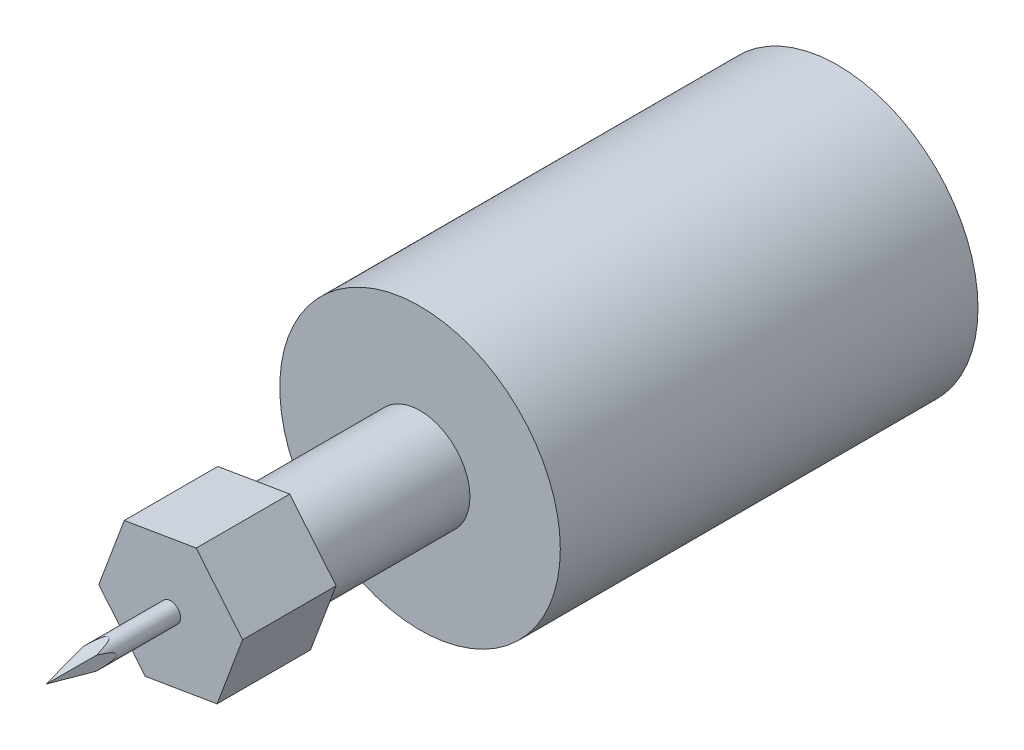
ISO-10303-21;
HEADER;
FILE_DESCRIPTION(('STEP AP214'),'2;1');
FILE_NAME('part.step','',(''),(''),'','','');
FILE_SCHEMA(('AUTOMOTIVE_DESIGN { 1 0 10303 214 1 1 1 1 }'));
ENDSEC;
DATA;
#1=APPLICATION_CONTEXT('core data for automotive mechanical design processes');
#2=APPLICATION_PROTOCOL_DEFINITION('international standard','automotive_design',2000,#1);
#3=PRODUCT_CONTEXT('',#1,'mechanical');
#4=PRODUCT('Part','Part','',(#3));
#5=PRODUCT_RELATED_PRODUCT_CATEGORY('part','',(#4));
#6=PRODUCT_DEFINITION_FORMATION('','',#4);
#7=PRODUCT_DEFINITION_CONTEXT('part definition',#1,'design');
#8=PRODUCT_DEFINITION('design','',#6,#7);
#9=PRODUCT_DEFINITION_SHAPE('','',#8);
#10=(LENGTH_UNIT() NAMED_UNIT(*) SI_UNIT(.MILLI.,.METRE.));
#11=(NAMED_UNIT(*) PLANE_ANGLE_UNIT() SI_UNIT($,.RADIAN.));
#12=(NAMED_UNIT(*) SI_UNIT($,.STERADIAN.) SOLID_ANGLE_UNIT());
#13=UNCERTAINTY_MEASURE_WITH_UNIT(LENGTH_MEASURE(1.E-05),#10,'distance_accuracy_value','');
#14=(GEOMETRIC_REPRESENTATION_CONTEXT(3) GLOBAL_UNCERTAINTY_ASSIGNED_CONTEXT((#13)) GLOBAL_UNIT_ASSIGNED_CONTEXT((#10,
#11,#12)) REPRESENTATION_CONTEXT('',''));
#15=CARTESIAN_POINT('',(0.,0.,0.));
#16=DIRECTION('',(0.,0.,1.));
#17=DIRECTION('',(1.,0.,0.));
#18=AXIS2_PLACEMENT_3D('',#15,#16,#17);
#19=CARTESIAN_POINT('',(0.,0.,0.));
#20=DIRECTION('',(0.,0.,1.));
#21=DIRECTION('',(1.,0.,0.));
#22=AXIS2_PLACEMENT_3D('',#19,#20,#21);
#23=PLANE('',#22);
#24=CARTESIAN_POINT('',(0.,0.,0.));
#25=DIRECTION('',(0.,0.,1.));
#26=DIRECTION('',(1.,0.,0.));
#27=AXIS2_PLACEMENT_3D('',#24,#25,#26);
#28=CIRCLE('',#27,22.5);
#29=CARTESIAN_POINT('',(22.5,0.,0.));
#30=VERTEX_POINT('',#29);
#31=EDGE_CURVE('E233',#30,#30,#28,.T.);
#32=ORIENTED_EDGE('',*,*,#31,.F.);
#33=EDGE_LOOP('',(#32));
#34=FACE_BOUND('',#33,.T.);
#35=CARTESIAN_POINT('',(0.,0.,0.));
#36=DIRECTION('',(0.,0.,1.));
#37=DIRECTION('',(1.,0.,0.));
#38=AXIS2_PLACEMENT_3D('',#35,#36,#37);
#39=CIRCLE('',#38,17.8959269683156);
#40=CARTESIAN_POINT('',(17.8959269683156,0.,0.));
#41=VERTEX_POINT('',#40);
#42=EDGE_CURVE('E12',#41,#41,#39,.F.);
#43=ORIENTED_EDGE('',*,*,#42,.F.);
#44=EDGE_LOOP('',(#43));
#45=FACE_BOUND('',#44,.T.);
#46=ADVANCED_FACE('F106',(#34,#45),#23,.F.);
#47=CARTESIAN_POINT('',(0.,0.,127.));
#48=DIRECTION('',(0.,0.,-1.));
#49=DIRECTION('',(-1.,0.,0.));
#50=AXIS2_PLACEMENT_3D('',#47,#48,#49);
#51=CYLINDRICAL_SURFACE('',#50,1.5875);
#52=CARTESIAN_POINT('',(0.,0.,107.));
#53=DIRECTION('',(0.,0.,1.));
#54=DIRECTION('',(1.,0.,0.));
#55=AXIS2_PLACEMENT_3D('',#52,#53,#54);
#56=CIRCLE('',#55,1.5875);
#57=CARTESIAN_POINT('',(1.5875,0.,107.));
#58=VERTEX_POINT('',#57);
#59=EDGE_CURVE('E211',#58,#58,#56,.T.);
#60=ORIENTED_EDGE('',*,*,#59,.T.);
#61=EDGE_LOOP('',(#60));
#62=FACE_BOUND('',#61,.T.);
#63=CARTESIAN_POINT('',(0.,0.,127.));
#64=DIRECTION('',(0.,-0.987632494264708,0.156786658464524));
#65=DIRECTION('',(0.,-0.156786658464524,-0.987632494264708));
#66=AXIS2_PLACEMENT_3D('',#63,#64,#65);
#67=ELLIPSE('',#66,10.1252237629594,1.5875);
#68=CARTESIAN_POINT('',(1.13749723845862,-1.1073645662107,120.024475173476));
#69=VERTEX_POINT('',#68);
#70=CARTESIAN_POINT('',(-1.12253201513364,-1.12253201513365,119.928932188135));
#71=VERTEX_POINT('',#70);
#72=EDGE_CURVE('E121',#69,#71,#67,.F.);
#73=ORIENTED_EDGE('',*,*,#72,.T.);
#74=CARTESIAN_POINT('',(0.,0.,127.));
#75=DIRECTION('',(-0.987632494264708,0.,0.156786658464523));
#76=DIRECTION('',(-0.156786658464523,0.,-0.987632494264708));
#77=AXIS2_PLACEMENT_3D('',#74,#75,#76);
#78=ELLIPSE('',#77,10.1252237629595,1.5875);
#79=CARTESIAN_POINT('',(-1.12253201513365,1.12253201513364,119.928932188135));
#80=VERTEX_POINT('',#79);
#81=EDGE_CURVE('E322',#71,#80,#78,.F.);
#82=ORIENTED_EDGE('',*,*,#81,.T.);
#83=CARTESIAN_POINT('',(0.,0.,127.));
#84=DIRECTION('',(0.,0.987632494264708,0.156786658464523));
#85=DIRECTION('',(0.,0.156786658464523,-0.987632494264708));
#86=AXIS2_PLACEMENT_3D('',#83,#84,#85);
#87=ELLIPSE('',#86,10.1252237629595,1.5875);
#88=CARTESIAN_POINT('',(1.13749723845863,1.1073645662107,120.024475173476));
#89=VERTEX_POINT('',#88);
#90=EDGE_CURVE('E328',#80,#89,#87,.F.);
#91=ORIENTED_EDGE('',*,*,#90,.T.);
#92=CARTESIAN_POINT('',(0.,0.,127.));
#93=DIRECTION('',(-0.986963552689711,0.,-0.160943920860975));
#94=DIRECTION('',(0.160943920860975,0.,-0.986963552689711));
#95=AXIS2_PLACEMENT_3D('',#92,#93,#94);
#96=ELLIPSE('',#95,9.86368414232497,1.5875);
#97=EDGE_CURVE('E325',#69,#89,#96,.F.);
#98=ORIENTED_EDGE('',*,*,#97,.F.);
#99=EDGE_LOOP('',(#73,#82,#91,#98));
#100=FACE_BOUND('',#99,.T.);
#101=ADVANCED_FACE('F257',(#62,#100),#51,.T.);
#102=CARTESIAN_POINT('',(-19.6656450179767,22.501,3.1219211466038));
#103=DIRECTION('',(-0.987632494264708,0.,0.156786658464523));
#104=DIRECTION('',(0.156786658464523,0.,0.987632494264709));
#105=AXIS2_PLACEMENT_3D('',#102,#103,#104);
#106=PLANE('',#105);
#107=ORIENTED_EDGE('',*,*,#81,.F.);
#108=DIRECTION('',(0.154894405240121,0.154894405240122,0.975712788914145));
#109=VECTOR('',#108,1.);
#110=CARTESIAN_POINT('',(-19.7336716394599,-19.73367163946,2.69340699552855));
#111=LINE('',#110,#109);
#112=CARTESIAN_POINT('',(0.,0.,127.));
#113=VERTEX_POINT('',#112);
#114=EDGE_CURVE('E337',#71,#113,#111,.T.);
#115=ORIENTED_EDGE('',*,*,#114,.T.);
#116=DIRECTION('',(-0.154894405240121,0.154894405240121,-0.975712788914145));
#117=VECTOR('',#116,1.);
#118=CARTESIAN_POINT('',(-0.539850219707323,0.539850219707317,123.599368694757));
#119=LINE('',#118,#117);
#120=EDGE_CURVE('E334',#113,#80,#119,.T.);
#121=ORIENTED_EDGE('',*,*,#120,.T.);
#122=EDGE_LOOP('',(#107,#115,#121));
#123=FACE_BOUND('',#122,.T.);
#124=ADVANCED_FACE('F264',(#123),#106,.T.);
#125=CARTESIAN_POINT('',(20.1734145574284,-22.501,3.28967409908716));
#126=DIRECTION('',(-0.986963552689711,0.,-0.160943920860975));
#127=DIRECTION('',(-0.160943920860975,0.,0.986963552689711));
#128=AXIS2_PLACEMENT_3D('',#125,#126,#127);
#129=PLANE('',#128);
#130=DIRECTION('',(0.159004076795252,-0.15479200702474,-0.975067760785753));
#131=VECTOR('',#130,1.);
#132=CARTESIAN_POINT('',(20.2589250899426,-19.7222595674333,2.76529406341315));
#133=LINE('',#132,#131);
#134=EDGE_CURVE('E340',#113,#69,#133,.T.);
#135=ORIENTED_EDGE('',*,*,#134,.T.);
#136=ORIENTED_EDGE('',*,*,#97,.T.);
#137=DIRECTION('',(-0.159004076795252,-0.154792007024739,0.975067760785753));
#138=VECTOR('',#137,1.);
#139=CARTESIAN_POINT('',(0.568876952140432,0.553807216435861,123.511450605128));
#140=LINE('',#139,#138);
#141=EDGE_CURVE('E331',#89,#113,#140,.T.);
#142=ORIENTED_EDGE('',*,*,#141,.T.);
#143=EDGE_LOOP('',(#135,#136,#142));
#144=FACE_BOUND('',#143,.T.);
#145=ADVANCED_FACE('F253',(#144),#129,.F.);
#146=CARTESIAN_POINT('',(0.,0.,107.));
#147=DIRECTION('',(0.,0.,1.));
#148=DIRECTION('',(1.,0.,0.));
#149=AXIS2_PLACEMENT_3D('',#146,#147,#148);
#150=PLANE('',#149);
#151=DIRECTION('',(0.350207381259462,0.9366721892484,0.));
#152=VECTOR('',#151,1.);
#153=CARTESIAN_POINT('',(7.43863571553628,-9.02378670105564,107.));
#154=LINE('',#153,#152);
#155=CARTESIAN_POINT('',(7.43863571553628,-9.02378670105564,107.));
#156=VERTEX_POINT('',#155);
#157=CARTESIAN_POINT('',(11.5341463792145,1.93015414862483,107.));
#158=VERTEX_POINT('',#157);
#159=EDGE_CURVE('E207',#156,#158,#154,.T.);
#160=ORIENTED_EDGE('',*,*,#159,.T.);
#161=DIRECTION('',(-0.636078220277769,0.771624583387716,0.));
#162=VECTOR('',#161,1.);
#163=CARTESIAN_POINT('',(11.5341463792145,1.93015414862483,107.));
#164=LINE('',#163,#162);
#165=CARTESIAN_POINT('',(4.09551066367822,10.9539408496805,107.));
#166=VERTEX_POINT('',#165);
#167=EDGE_CURVE('E210',#158,#166,#164,.T.);
#168=ORIENTED_EDGE('',*,*,#167,.T.);
#169=DIRECTION('',(-0.98628560153723,-0.165047605860683,0.));
#170=VECTOR('',#169,1.);
#171=CARTESIAN_POINT('',(4.09551066367822,10.9539408496805,107.));
#172=LINE('',#171,#170);
#173=CARTESIAN_POINT('',(-7.43863571553628,9.02378670105564,107.));
#174=VERTEX_POINT('',#173);
#175=EDGE_CURVE('E214',#166,#174,#172,.T.);
#176=ORIENTED_EDGE('',*,*,#175,.T.);
#177=DIRECTION('',(-0.350207381259462,-0.9366721892484,0.));
#178=VECTOR('',#177,1.);
#179=CARTESIAN_POINT('',(-7.43863571553628,9.02378670105564,107.));
#180=LINE('',#179,#178);
#181=CARTESIAN_POINT('',(-11.5341463792145,-1.93015414862484,107.));
#182=VERTEX_POINT('',#181);
#183=EDGE_CURVE('E217',#174,#182,#180,.T.);
#184=ORIENTED_EDGE('',*,*,#183,.T.);
#185=DIRECTION('',(0.636078220277769,-0.771624583387716,0.));
#186=VECTOR('',#185,1.);
#187=CARTESIAN_POINT('',(-11.5341463792145,-1.93015414862484,107.));
#188=LINE('',#187,#186);
#189=CARTESIAN_POINT('',(-4.09551066367821,-10.9539408496805,107.));
#190=VERTEX_POINT('',#189);
#191=EDGE_CURVE('E182',#182,#190,#188,.T.);
#192=ORIENTED_EDGE('',*,*,#191,.T.);
#193=DIRECTION('',(0.98628560153723,0.165047605860683,0.));
#194=VECTOR('',#193,1.);
#195=CARTESIAN_POINT('',(-4.09551066367821,-10.9539408496805,107.));
#196=LINE('',#195,#194);
#197=EDGE_CURVE('E220',#190,#156,#196,.T.);
#198=ORIENTED_EDGE('',*,*,#197,.T.);
#199=EDGE_LOOP('',(#160,#168,#176,#184,#192,#198));
#200=FACE_BOUND('',#199,.T.);
#201=ORIENTED_EDGE('',*,*,#59,.F.);
#202=EDGE_LOOP('',(#201));
#203=FACE_BOUND('',#202,.T.);
#204=ADVANCED_FACE('F244',(#200,#203),#150,.T.);
#205=CARTESIAN_POINT('',(0.,0.,107.));
#206=DIRECTION('',(0.,0.,-1.));
#207=DIRECTION('',(-1.,0.,0.));
#208=AXIS2_PLACEMENT_3D('',#205,#206,#207);
#209=CYLINDRICAL_SURFACE('',#208,8.);
#210=CARTESIAN_POINT('',(0.,0.,67.));
#211=DIRECTION('',(0.,0.,1.));
#212=DIRECTION('',(1.,0.,0.));
#213=AXIS2_PLACEMENT_3D('',#210,#211,#212);
#214=CIRCLE('',#213,8.);
#215=CARTESIAN_POINT('',(8.,0.,67.));
#216=VERTEX_POINT('',#215);
#217=EDGE_CURVE('E225',#216,#216,#214,.T.);
#218=ORIENTED_EDGE('',*,*,#217,.T.);
#219=EDGE_LOOP('',(#218));
#220=FACE_BOUND('',#219,.T.);
#221=CARTESIAN_POINT('',(0.,0.,92.));
#222=DIRECTION('',(0.,0.,1.));
#223=DIRECTION('',(1.,0.,0.));
#224=AXIS2_PLACEMENT_3D('',#221,#222,#223);
#225=CIRCLE('',#224,8.);
#226=CARTESIAN_POINT('',(8.,0.,92.));
#227=VERTEX_POINT('',#226);
#228=EDGE_CURVE('E114',#227,#227,#225,.T.);
#229=ORIENTED_EDGE('',*,*,#228,.F.);
#230=EDGE_LOOP('',(#229));
#231=FACE_BOUND('',#230,.T.);
#232=ADVANCED_FACE('F241',(#220,#231),#209,.T.);
#233=CARTESIAN_POINT('',(0.,0.,67.));
#234=DIRECTION('',(0.,0.,1.));
#235=DIRECTION('',(1.,0.,0.));
#236=AXIS2_PLACEMENT_3D('',#233,#234,#235);
#237=PLANE('',#236);
#238=CARTESIAN_POINT('',(0.,0.,67.));
#239=DIRECTION('',(0.,0.,1.));
#240=DIRECTION('',(1.,0.,0.));
#241=AXIS2_PLACEMENT_3D('',#238,#239,#240);
#242=CIRCLE('',#241,22.5);
#243=CARTESIAN_POINT('',(22.5,0.,67.));
#244=VERTEX_POINT('',#243);
#245=EDGE_CURVE('E234',#244,#244,#242,.T.);
#246=ORIENTED_EDGE('',*,*,#245,.T.);
#247=EDGE_LOOP('',(#246));
#248=FACE_BOUND('',#247,.T.);
#249=ORIENTED_EDGE('',*,*,#217,.F.);
#250=EDGE_LOOP('',(#249));
#251=FACE_BOUND('',#250,.T.);
#252=ADVANCED_FACE('F243',(#248,#251),#237,.T.);
#253=CARTESIAN_POINT('',(0.,0.,67.));
#254=DIRECTION('',(0.,0.,-1.));
#255=DIRECTION('',(-1.,0.,0.));
#256=AXIS2_PLACEMENT_3D('',#253,#254,#255);
#257=CYLINDRICAL_SURFACE('',#256,22.5);
#258=ORIENTED_EDGE('',*,*,#245,.F.);
#259=EDGE_LOOP('',(#258));
#260=FACE_BOUND('',#259,.T.);
#261=ORIENTED_EDGE('',*,*,#31,.T.);
#262=EDGE_LOOP('',(#261));
#263=FACE_BOUND('',#262,.T.);
#264=ADVANCED_FACE('F108',(#260,#263),#257,.T.);
#265=CARTESIAN_POINT('',(0.,0.,92.));
#266=DIRECTION('',(0.,0.,1.));
#267=DIRECTION('',(1.,0.,0.));
#268=AXIS2_PLACEMENT_3D('',#265,#266,#267);
#269=PLANE('',#268);
#270=DIRECTION('',(0.350207381259462,0.9366721892484,0.));
#271=VECTOR('',#270,1.);
#272=CARTESIAN_POINT('',(7.43863571553628,-9.02378670105564,92.));
#273=LINE('',#272,#271);
#274=CARTESIAN_POINT('',(7.43863571553628,-9.02378670105564,92.));
#275=VERTEX_POINT('',#274);
#276=CARTESIAN_POINT('',(11.5341463792145,1.93015414862483,92.));
#277=VERTEX_POINT('',#276);
#278=EDGE_CURVE('E223',#275,#277,#273,.T.);
#279=ORIENTED_EDGE('',*,*,#278,.F.);
#280=DIRECTION('',(0.98628560153723,0.165047605860683,0.));
#281=VECTOR('',#280,1.);
#282=CARTESIAN_POINT('',(-4.09551066367821,-10.9539408496805,92.));
#283=LINE('',#282,#281);
#284=CARTESIAN_POINT('',(-4.09551066367821,-10.9539408496805,92.));
#285=VERTEX_POINT('',#284);
#286=EDGE_CURVE('E197',#285,#275,#283,.T.);
#287=ORIENTED_EDGE('',*,*,#286,.F.);
#288=DIRECTION('',(0.636078220277769,-0.771624583387716,0.));
#289=VECTOR('',#288,1.);
#290=CARTESIAN_POINT('',(-11.5341463792145,-1.93015414862484,92.));
#291=LINE('',#290,#289);
#292=CARTESIAN_POINT('',(-11.5341463792145,-1.93015414862484,92.));
#293=VERTEX_POINT('',#292);
#294=EDGE_CURVE('E179',#293,#285,#291,.T.);
#295=ORIENTED_EDGE('',*,*,#294,.F.);
#296=DIRECTION('',(-0.350207381259462,-0.9366721892484,0.));
#297=VECTOR('',#296,1.);
#298=CARTESIAN_POINT('',(-7.43863571553628,9.02378670105564,92.));
#299=LINE('',#298,#297);
#300=CARTESIAN_POINT('',(-7.43863571553628,9.02378670105564,92.));
#301=VERTEX_POINT('',#300);
#302=EDGE_CURVE('E195',#301,#293,#299,.T.);
#303=ORIENTED_EDGE('',*,*,#302,.F.);
#304=DIRECTION('',(-0.98628560153723,-0.165047605860683,0.));
#305=VECTOR('',#304,1.);
#306=CARTESIAN_POINT('',(4.09551066367822,10.9539408496805,92.));
#307=LINE('',#306,#305);
#308=CARTESIAN_POINT('',(4.09551066367822,10.9539408496805,92.));
#309=VERTEX_POINT('',#308);
#310=EDGE_CURVE('E200',#309,#301,#307,.T.);
#311=ORIENTED_EDGE('',*,*,#310,.F.);
#312=DIRECTION('',(-0.636078220277769,0.771624583387716,0.));
#313=VECTOR('',#312,1.);
#314=CARTESIAN_POINT('',(11.5341463792145,1.93015414862483,92.));
#315=LINE('',#314,#313);
#316=EDGE_CURVE('E202',#277,#309,#315,.T.);
#317=ORIENTED_EDGE('',*,*,#316,.F.);
#318=EDGE_LOOP('',(#279,#287,#295,#303,#311,#317));
#319=FACE_BOUND('',#318,.T.);
#320=ORIENTED_EDGE('',*,*,#228,.T.);
#321=EDGE_LOOP('',(#320));
#322=FACE_BOUND('',#321,.T.);
#323=ADVANCED_FACE('F192',(#319,#322),#269,.F.);
#324=CARTESIAN_POINT('',(7.43863571553628,-9.02378670105564,92.));
#325=DIRECTION('',(0.9366721892484,-0.350207381259462,0.));
#326=DIRECTION('',(0.350207381259462,0.9366721892484,0.));
#327=AXIS2_PLACEMENT_3D('',#324,#325,#326);
#328=PLANE('',#327);
#329=ORIENTED_EDGE('',*,*,#159,.F.);
#330=DIRECTION('',(0.,0.,1.));
#331=VECTOR('',#330,1.);
#332=CARTESIAN_POINT('',(7.43863571553628,-9.02378670105564,92.));
#333=LINE('',#332,#331);
#334=EDGE_CURVE('E130',#275,#156,#333,.T.);
#335=ORIENTED_EDGE('',*,*,#334,.F.);
#336=ORIENTED_EDGE('',*,*,#278,.T.);
#337=DIRECTION('',(0.,0.,1.));
#338=VECTOR('',#337,1.);
#339=CARTESIAN_POINT('',(11.5341463792145,1.93015414862483,92.));
#340=LINE('',#339,#338);
#341=EDGE_CURVE('E163',#277,#158,#340,.T.);
#342=ORIENTED_EDGE('',*,*,#341,.T.);
#343=EDGE_LOOP('',(#329,#335,#336,#342));
#344=FACE_BOUND('',#343,.T.);
#345=ADVANCED_FACE('F299',(#344),#328,.T.);
#346=CARTESIAN_POINT('',(-4.09551066367821,-10.9539408496805,92.));
#347=DIRECTION('',(0.165047605860683,-0.98628560153723,0.));
#348=DIRECTION('',(0.98628560153723,0.165047605860683,0.));
#349=AXIS2_PLACEMENT_3D('',#346,#347,#348);
#350=PLANE('',#349);
#351=ORIENTED_EDGE('',*,*,#197,.F.);
#352=DIRECTION('',(0.,0.,1.));
#353=VECTOR('',#352,1.);
#354=CARTESIAN_POINT('',(-4.09551066367821,-10.9539408496805,92.));
#355=LINE('',#354,#353);
#356=EDGE_CURVE('E187',#285,#190,#355,.T.);
#357=ORIENTED_EDGE('',*,*,#356,.F.);
#358=ORIENTED_EDGE('',*,*,#286,.T.);
#359=ORIENTED_EDGE('',*,*,#334,.T.);
#360=EDGE_LOOP('',(#351,#357,#358,#359));
#361=FACE_BOUND('',#360,.T.);
#362=ADVANCED_FACE('F300',(#361),#350,.T.);
#363=CARTESIAN_POINT('',(-11.5341463792145,-1.93015414862484,92.));
#364=DIRECTION('',(-0.771624583387716,-0.636078220277769,0.));
#365=DIRECTION('',(0.636078220277769,-0.771624583387716,0.));
#366=AXIS2_PLACEMENT_3D('',#363,#364,#365);
#367=PLANE('',#366);
#368=ORIENTED_EDGE('',*,*,#191,.F.);
#369=DIRECTION('',(0.,0.,1.));
#370=VECTOR('',#369,1.);
#371=CARTESIAN_POINT('',(-11.5341463792145,-1.93015414862484,92.));
#372=LINE('',#371,#370);
#373=EDGE_CURVE('E176',#293,#182,#372,.T.);
#374=ORIENTED_EDGE('',*,*,#373,.F.);
#375=ORIENTED_EDGE('',*,*,#294,.T.);
#376=ORIENTED_EDGE('',*,*,#356,.T.);
#377=EDGE_LOOP('',(#368,#374,#375,#376));
#378=FACE_BOUND('',#377,.T.);
#379=ADVANCED_FACE('F178',(#378),#367,.T.);
#380=CARTESIAN_POINT('',(-7.43863571553628,9.02378670105564,92.));
#381=DIRECTION('',(-0.9366721892484,0.350207381259462,0.));
#382=DIRECTION('',(-0.350207381259462,-0.9366721892484,0.));
#383=AXIS2_PLACEMENT_3D('',#380,#381,#382);
#384=PLANE('',#383);
#385=ORIENTED_EDGE('',*,*,#183,.F.);
#386=DIRECTION('',(0.,0.,1.));
#387=VECTOR('',#386,1.);
#388=CARTESIAN_POINT('',(-7.43863571553628,9.02378670105564,92.));
#389=LINE('',#388,#387);
#390=EDGE_CURVE('E188',#301,#174,#389,.T.);
#391=ORIENTED_EDGE('',*,*,#390,.F.);
#392=ORIENTED_EDGE('',*,*,#302,.T.);
#393=ORIENTED_EDGE('',*,*,#373,.T.);
#394=EDGE_LOOP('',(#385,#391,#392,#393));
#395=FACE_BOUND('',#394,.T.);
#396=ADVANCED_FACE('F199',(#395),#384,.T.);
#397=CARTESIAN_POINT('',(4.09551066367822,10.9539408496805,92.));
#398=DIRECTION('',(-0.165047605860683,0.98628560153723,0.));
#399=DIRECTION('',(-0.986285601537231,-0.165047605860683,0.));
#400=AXIS2_PLACEMENT_3D('',#397,#398,#399);
#401=PLANE('',#400);
#402=ORIENTED_EDGE('',*,*,#175,.F.);
#403=DIRECTION('',(0.,0.,1.));
#404=VECTOR('',#403,1.);
#405=CARTESIAN_POINT('',(4.09551066367822,10.9539408496805,92.));
#406=LINE('',#405,#404);
#407=EDGE_CURVE('E228',#309,#166,#406,.T.);
#408=ORIENTED_EDGE('',*,*,#407,.F.);
#409=ORIENTED_EDGE('',*,*,#310,.T.);
#410=ORIENTED_EDGE('',*,*,#390,.T.);
#411=EDGE_LOOP('',(#402,#408,#409,#410));
#412=FACE_BOUND('',#411,.T.);
#413=ADVANCED_FACE('F307',(#412),#401,.T.);
#414=CARTESIAN_POINT('',(11.5341463792145,1.93015414862483,92.));
#415=DIRECTION('',(0.771624583387716,0.636078220277768,0.));
#416=DIRECTION('',(-0.636078220277769,0.771624583387716,0.));
#417=AXIS2_PLACEMENT_3D('',#414,#415,#416);
#418=PLANE('',#417);
#419=ORIENTED_EDGE('',*,*,#167,.F.);
#420=ORIENTED_EDGE('',*,*,#341,.F.);
#421=ORIENTED_EDGE('',*,*,#316,.T.);
#422=ORIENTED_EDGE('',*,*,#407,.T.);
#423=EDGE_LOOP('',(#419,#420,#421,#422));
#424=FACE_BOUND('',#423,.T.);
#425=ADVANCED_FACE('F289',(#424),#418,.T.);
#426=CARTESIAN_POINT('',(22.501,0.,127.));
#427=DIRECTION('',(0.,0.987632494264708,0.156786658464523));
#428=DIRECTION('',(0.,-0.156786658464523,0.987632494264708));
#429=AXIS2_PLACEMENT_3D('',#426,#427,#428);
#430=PLANE('',#429);
#431=ORIENTED_EDGE('',*,*,#141,.F.);
#432=ORIENTED_EDGE('',*,*,#90,.F.);
#433=ORIENTED_EDGE('',*,*,#120,.F.);
#434=EDGE_LOOP('',(#431,#432,#433));
#435=FACE_BOUND('',#434,.T.);
#436=ADVANCED_FACE('F283',(#435),#430,.T.);
#437=CARTESIAN_POINT('',(22.501,-19.6656450179768,3.12192114660384));
#438=DIRECTION('',(0.,-0.987632494264708,0.156786658464524));
#439=DIRECTION('',(0.,-0.156786658464524,-0.987632494264708));
#440=AXIS2_PLACEMENT_3D('',#437,#438,#439);
#441=PLANE('',#440);
#442=ORIENTED_EDGE('',*,*,#134,.F.);
#443=ORIENTED_EDGE('',*,*,#114,.F.);
#444=ORIENTED_EDGE('',*,*,#72,.F.);
#445=EDGE_LOOP('',(#442,#443,#444));
#446=FACE_BOUND('',#445,.T.);
#447=ADVANCED_FACE('F274',(#446),#441,.T.);
#448=CARTESIAN_POINT('',(0.,0.,-2.));
#449=DIRECTION('',(0.,0.,1.));
#450=DIRECTION('',(1.,0.,0.));
#451=AXIS2_PLACEMENT_3D('',#448,#449,#450);
#452=CYLINDRICAL_SURFACE('',#451,17.8959269683156);
#453=CARTESIAN_POINT('',(0.,0.,-2.));
#454=DIRECTION('',(0.,0.,-1.));
#455=DIRECTION('',(-1.,0.,0.));
#456=AXIS2_PLACEMENT_3D('',#453,#454,#455);
#457=CIRCLE('',#456,17.8959269683156);
#458=CARTESIAN_POINT('',(-17.8959269683156,0.,-2.));
#459=VERTEX_POINT('',#458);
#460=EDGE_CURVE('E343',#459,#459,#457,.T.);
#461=ORIENTED_EDGE('',*,*,#460,.F.);
#462=EDGE_LOOP('',(#461));
#463=FACE_BOUND('',#462,.T.);
#464=ORIENTED_EDGE('',*,*,#42,.T.);
#465=EDGE_LOOP('',(#464));
#466=FACE_BOUND('',#465,.T.);
#467=ADVANCED_FACE('F271',(#463,#466),#452,.T.);
#468=CARTESIAN_POINT('',(0.,0.,-2.));
#469=DIRECTION('',(0.,0.,-1.));
#470=DIRECTION('',(-1.,0.,0.));
#471=AXIS2_PLACEMENT_3D('',#468,#469,#470);
#472=PLANE('',#471);
#473=ORIENTED_EDGE('',*,*,#460,.T.);
#474=EDGE_LOOP('',(#473));
#475=FACE_BOUND('',#474,.T.);
#476=ADVANCED_FACE('F273',(#475),#472,.T.);
#477=CLOSED_SHELL('',(#46,#101,#124,#145,#204,#232,#252,#264,#323,#345,#362,#379,#396,#413,#425,
#436,#447,#467,#476));
#478=MANIFOLD_SOLID_BREP('B2',#477);
#479=ADVANCED_BREP_SHAPE_REPRESENTATION('',(#18,#478),#14);
#480=SHAPE_DEFINITION_REPRESENTATION(#9,#479);
ENDSEC;
END-ISO-10303-21;
